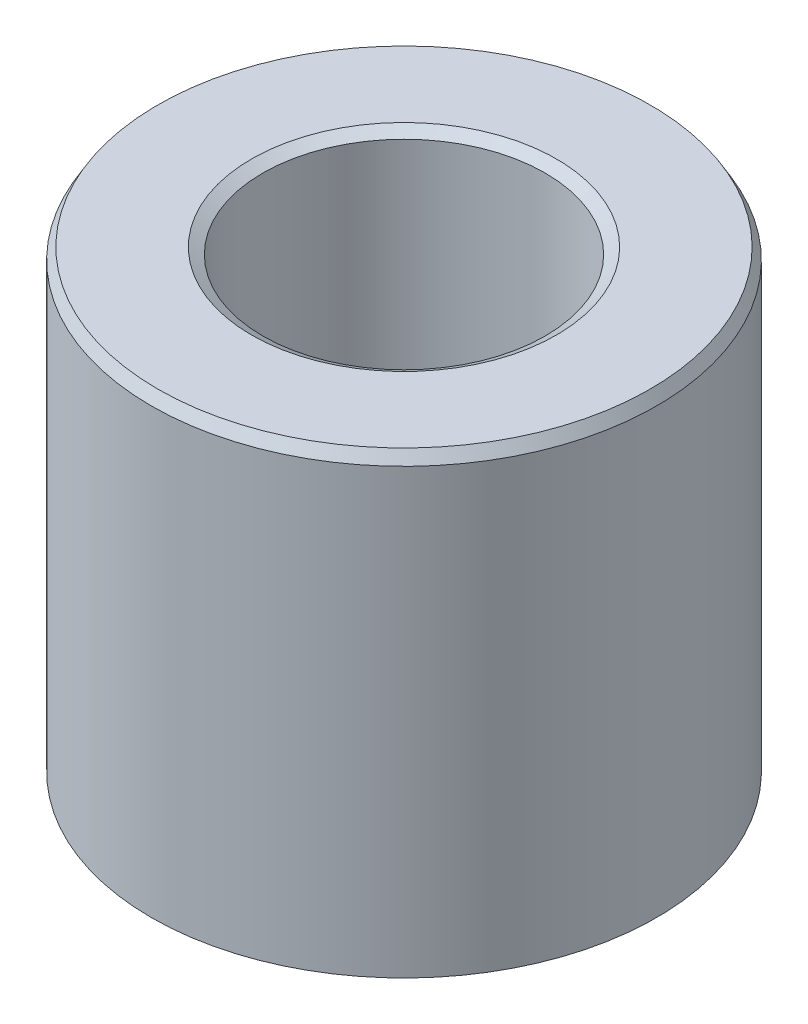
ISO-10303-21;
HEADER;
FILE_DESCRIPTION(('STEP AP214'),'2;1');
FILE_NAME('part.step','',(''),(''),'','','');
FILE_SCHEMA(('AUTOMOTIVE_DESIGN { 1 0 10303 214 1 1 1 1 }'));
ENDSEC;
DATA;
#1=APPLICATION_CONTEXT('core data for automotive mechanical design processes');
#2=APPLICATION_PROTOCOL_DEFINITION('international standard','automotive_design',2000,#1);
#3=PRODUCT_CONTEXT('',#1,'mechanical');
#4=PRODUCT('Part','Part','',(#3));
#5=PRODUCT_RELATED_PRODUCT_CATEGORY('part','',(#4));
#6=PRODUCT_DEFINITION_FORMATION('','',#4);
#7=PRODUCT_DEFINITION_CONTEXT('part definition',#1,'design');
#8=PRODUCT_DEFINITION('design','',#6,#7);
#9=PRODUCT_DEFINITION_SHAPE('','',#8);
#10=(LENGTH_UNIT() NAMED_UNIT(*) SI_UNIT(.MILLI.,.METRE.));
#11=(NAMED_UNIT(*) PLANE_ANGLE_UNIT() SI_UNIT($,.RADIAN.));
#12=(NAMED_UNIT(*) SI_UNIT($,.STERADIAN.) SOLID_ANGLE_UNIT());
#13=UNCERTAINTY_MEASURE_WITH_UNIT(LENGTH_MEASURE(1.E-05),#10,'distance_accuracy_value','');
#14=(GEOMETRIC_REPRESENTATION_CONTEXT(3) GLOBAL_UNCERTAINTY_ASSIGNED_CONTEXT((#13)) GLOBAL_UNIT_ASSIGNED_CONTEXT((#10,
#11,#12)) REPRESENTATION_CONTEXT('',''));
#15=CARTESIAN_POINT('',(0.,0.,0.));
#16=DIRECTION('',(0.,0.,1.));
#17=DIRECTION('',(1.,0.,0.));
#18=AXIS2_PLACEMENT_3D('',#15,#16,#17);
#19=CARTESIAN_POINT('',(0.,77.5242149699708,0.));
#20=DIRECTION('',(0.,-1.,0.));
#21=DIRECTION('',(0.,0.,-1.));
#22=AXIS2_PLACEMENT_3D('',#19,#20,#21);
#23=CYLINDRICAL_SURFACE('',#22,42.5);
#24=CARTESIAN_POINT('',(0.,1.09705387541063,0.));
#25=DIRECTION('',(0.,1.,0.));
#26=DIRECTION('',(0.,0.,1.));
#27=AXIS2_PLACEMENT_3D('',#24,#25,#26);
#28=CIRCLE('',#27,42.5);
#29=CARTESIAN_POINT('',(0.,1.09705387541063,42.5));
#30=VERTEX_POINT('',#29);
#31=EDGE_CURVE('E10',#30,#30,#28,.T.);
#32=ORIENTED_EDGE('',*,*,#31,.T.);
#33=EDGE_LOOP('',(#32));
#34=FACE_BOUND('',#33,.T.);
#35=CARTESIAN_POINT('',(0.,75.6240619191192,0.));
#36=DIRECTION('',(0.,1.,0.));
#37=DIRECTION('',(0.,0.,1.));
#38=AXIS2_PLACEMENT_3D('',#35,#36,#37);
#39=CIRCLE('',#38,42.5);
#40=CARTESIAN_POINT('',(0.,75.6240619191192,42.5));
#41=VERTEX_POINT('',#40);
#42=EDGE_CURVE('E50',#41,#41,#39,.F.);
#43=ORIENTED_EDGE('',*,*,#42,.T.);
#44=EDGE_LOOP('',(#43));
#45=FACE_BOUND('',#44,.T.);
#46=ADVANCED_FACE('F39',(#34,#45),#23,.T.);
#47=CARTESIAN_POINT('',(0.,77.5242149699708,0.));
#48=DIRECTION('',(0.,1.,0.));
#49=DIRECTION('',(0.,0.,1.));
#50=AXIS2_PLACEMENT_3D('',#47,#48,#49);
#51=PLANE('',#50);
#52=CARTESIAN_POINT('',(0.,77.5242149699708,0.));
#53=DIRECTION('',(0.,1.,0.));
#54=DIRECTION('',(0.,0.,1.));
#55=AXIS2_PLACEMENT_3D('',#52,#53,#54);
#56=CIRCLE('',#55,25.6479922741123);
#57=CARTESIAN_POINT('',(0.,77.5242149699708,25.6479922741123));
#58=VERTEX_POINT('',#57);
#59=EDGE_CURVE('E58',#58,#58,#56,.F.);
#60=ORIENTED_EDGE('',*,*,#59,.T.);
#61=EDGE_LOOP('',(#60));
#62=FACE_BOUND('',#61,.T.);
#63=CARTESIAN_POINT('',(0.,77.5242149699708,0.));
#64=DIRECTION('',(0.,1.,0.));
#65=DIRECTION('',(0.,0.,1.));
#66=AXIS2_PLACEMENT_3D('',#63,#64,#65);
#67=CIRCLE('',#66,41.4029461245894);
#68=CARTESIAN_POINT('',(0.,77.5242149699708,41.4029461245894));
#69=VERTEX_POINT('',#68);
#70=EDGE_CURVE('E61',#69,#69,#67,.T.);
#71=ORIENTED_EDGE('',*,*,#70,.T.);
#72=EDGE_LOOP('',(#71));
#73=FACE_BOUND('',#72,.T.);
#74=ADVANCED_FACE('F88',(#62,#73),#51,.T.);
#75=CARTESIAN_POINT('',(0.,0.,0.));
#76=DIRECTION('',(0.,1.,0.));
#77=DIRECTION('',(0.,0.,1.));
#78=AXIS2_PLACEMENT_3D('',#75,#76,#77);
#79=PLANE('',#78);
#80=CARTESIAN_POINT('',(0.,0.,0.));
#81=DIRECTION('',(0.,1.,0.));
#82=DIRECTION('',(0.,0.,1.));
#83=AXIS2_PLACEMENT_3D('',#80,#81,#82);
#84=CIRCLE('',#83,24.8448930986714);
#85=CARTESIAN_POINT('',(0.,0.,24.8448930986714));
#86=VERTEX_POINT('',#85);
#87=EDGE_CURVE('E51',#86,#86,#84,.T.);
#88=ORIENTED_EDGE('',*,*,#87,.T.);
#89=EDGE_LOOP('',(#88));
#90=FACE_BOUND('',#89,.T.);
#91=CARTESIAN_POINT('',(0.,0.,0.));
#92=DIRECTION('',(0.,1.,0.));
#93=DIRECTION('',(0.,0.,1.));
#94=AXIS2_PLACEMENT_3D('',#91,#92,#93);
#95=CIRCLE('',#94,40.5998469491484);
#96=CARTESIAN_POINT('',(0.,0.,40.5998469491484));
#97=VERTEX_POINT('',#96);
#98=EDGE_CURVE('E54',#97,#97,#95,.F.);
#99=ORIENTED_EDGE('',*,*,#98,.T.);
#100=EDGE_LOOP('',(#99));
#101=FACE_BOUND('',#100,.T.);
#102=ADVANCED_FACE('F83',(#90,#101),#79,.F.);
#103=CARTESIAN_POINT('',(0.,77.5242149699708,0.));
#104=DIRECTION('',(0.,-1.,0.));
#105=DIRECTION('',(0.,0.,-1.));
#106=AXIS2_PLACEMENT_3D('',#103,#104,#105);
#107=CYLINDRICAL_SURFACE('',#106,23.7478392232607);
#108=CARTESIAN_POINT('',(0.,76.4271610945601,0.));
#109=DIRECTION('',(0.,1.,0.));
#110=DIRECTION('',(0.,0.,1.));
#111=AXIS2_PLACEMENT_3D('',#108,#109,#110);
#112=CIRCLE('',#111,23.7478392232607);
#113=CARTESIAN_POINT('',(0.,76.4271610945601,23.7478392232607));
#114=VERTEX_POINT('',#113);
#115=EDGE_CURVE('E67',#114,#114,#112,.T.);
#116=ORIENTED_EDGE('',*,*,#115,.T.);
#117=EDGE_LOOP('',(#116));
#118=FACE_BOUND('',#117,.T.);
#119=CARTESIAN_POINT('',(0.,1.90015305085156,0.));
#120=DIRECTION('',(0.,1.,0.));
#121=DIRECTION('',(0.,0.,1.));
#122=AXIS2_PLACEMENT_3D('',#119,#120,#121);
#123=CIRCLE('',#122,23.7478392232607);
#124=CARTESIAN_POINT('',(0.,1.90015305085156,23.7478392232607));
#125=VERTEX_POINT('',#124);
#126=EDGE_CURVE('E69',#125,#125,#123,.F.);
#127=ORIENTED_EDGE('',*,*,#126,.T.);
#128=EDGE_LOOP('',(#127));
#129=FACE_BOUND('',#128,.T.);
#130=ADVANCED_FACE('F71',(#118,#129),#107,.F.);
#131=CARTESIAN_POINT('',(0.,76.4271610945601,0.));
#132=DIRECTION('',(0.,1.,0.));
#133=DIRECTION('',(0.,0.,1.));
#134=AXIS2_PLACEMENT_3D('',#131,#132,#133);
#135=CONICAL_SURFACE('',#134,23.7478392232607,1.0471975511966);
#136=ORIENTED_EDGE('',*,*,#59,.F.);
#137=EDGE_LOOP('',(#136));
#138=FACE_BOUND('',#137,.T.);
#139=ORIENTED_EDGE('',*,*,#115,.F.);
#140=EDGE_LOOP('',(#139));
#141=FACE_BOUND('',#140,.T.);
#142=ADVANCED_FACE('F77',(#138,#141),#135,.F.);
#143=CARTESIAN_POINT('',(0.,0.,0.));
#144=DIRECTION('',(0.,-1.,0.));
#145=DIRECTION('',(0.,0.,-1.));
#146=AXIS2_PLACEMENT_3D('',#143,#144,#145);
#147=CONICAL_SURFACE('',#146,24.8448930986714,0.523598775598295);
#148=ORIENTED_EDGE('',*,*,#126,.F.);
#149=EDGE_LOOP('',(#148));
#150=FACE_BOUND('',#149,.T.);
#151=ORIENTED_EDGE('',*,*,#87,.F.);
#152=EDGE_LOOP('',(#151));
#153=FACE_BOUND('',#152,.T.);
#154=ADVANCED_FACE('F73',(#150,#153),#147,.F.);
#155=CARTESIAN_POINT('',(0.,1.09705387541063,0.));
#156=DIRECTION('',(0.,1.,0.));
#157=DIRECTION('',(0.,0.,1.));
#158=AXIS2_PLACEMENT_3D('',#155,#156,#157);
#159=CONICAL_SURFACE('',#158,42.5,1.0471975511966);
#160=ORIENTED_EDGE('',*,*,#98,.F.);
#161=EDGE_LOOP('',(#160));
#162=FACE_BOUND('',#161,.T.);
#163=ORIENTED_EDGE('',*,*,#31,.F.);
#164=EDGE_LOOP('',(#163));
#165=FACE_BOUND('',#164,.T.);
#166=ADVANCED_FACE('F76',(#162,#165),#159,.T.);
#167=CARTESIAN_POINT('',(0.,77.5242149699708,0.));
#168=DIRECTION('',(0.,-1.,0.));
#169=DIRECTION('',(0.,0.,-1.));
#170=AXIS2_PLACEMENT_3D('',#167,#168,#169);
#171=CONICAL_SURFACE('',#170,41.4029461245894,0.523598775598293);
#172=ORIENTED_EDGE('',*,*,#42,.F.);
#173=EDGE_LOOP('',(#172));
#174=FACE_BOUND('',#173,.T.);
#175=ORIENTED_EDGE('',*,*,#70,.F.);
#176=EDGE_LOOP('',(#175));
#177=FACE_BOUND('',#176,.T.);
#178=ADVANCED_FACE('F45',(#174,#177),#171,.T.);
#179=CLOSED_SHELL('',(#46,#74,#102,#130,#142,#154,#166,#178));
#180=MANIFOLD_SOLID_BREP('B2',#179);
#181=ADVANCED_BREP_SHAPE_REPRESENTATION('',(#18,#180),#14);
#182=SHAPE_DEFINITION_REPRESENTATION(#9,#181);
ENDSEC;
END-ISO-10303-21;
